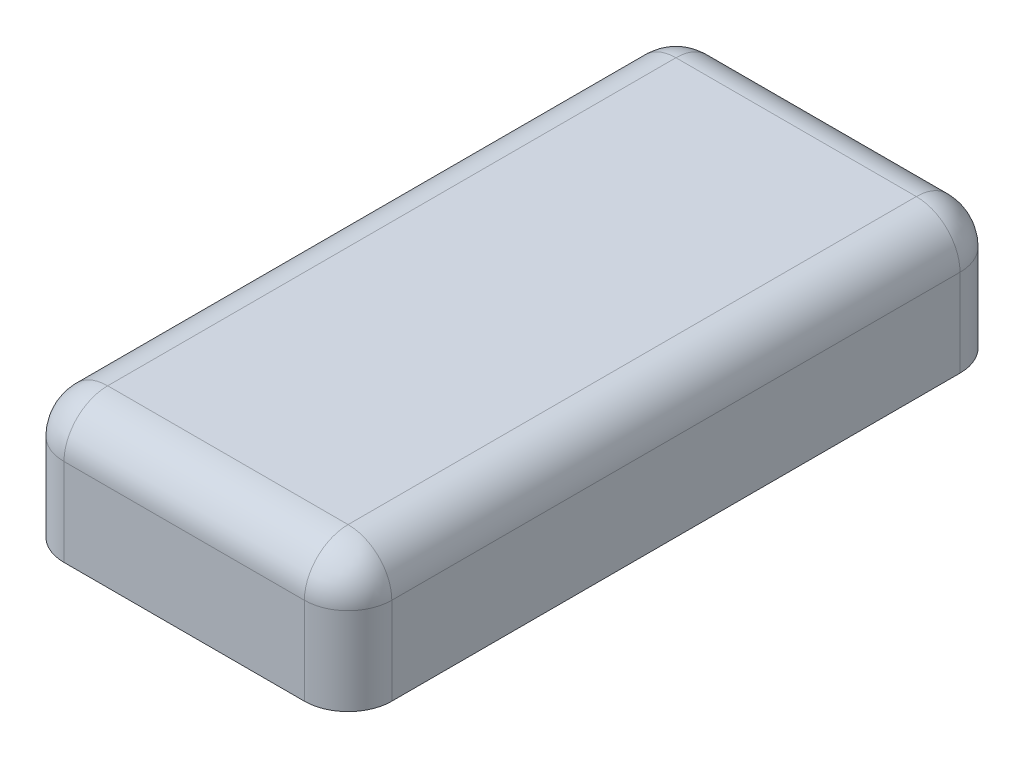
ISO-10303-21;
HEADER;
FILE_DESCRIPTION(('STEP AP214'),'2;1');
FILE_NAME('part.step','',(''),(''),'','','');
FILE_SCHEMA(('AUTOMOTIVE_DESIGN { 1 0 10303 214 1 1 1 1 }'));
ENDSEC;
DATA;
#1=APPLICATION_CONTEXT('core data for automotive mechanical design processes');
#2=APPLICATION_PROTOCOL_DEFINITION('international standard','automotive_design',2000,#1);
#3=PRODUCT_CONTEXT('',#1,'mechanical');
#4=PRODUCT('Part','Part','',(#3));
#5=PRODUCT_RELATED_PRODUCT_CATEGORY('part','',(#4));
#6=PRODUCT_DEFINITION_FORMATION('','',#4);
#7=PRODUCT_DEFINITION_CONTEXT('part definition',#1,'design');
#8=PRODUCT_DEFINITION('design','',#6,#7);
#9=PRODUCT_DEFINITION_SHAPE('','',#8);
#10=(LENGTH_UNIT() NAMED_UNIT(*) SI_UNIT(.MILLI.,.METRE.));
#11=(NAMED_UNIT(*) PLANE_ANGLE_UNIT() SI_UNIT($,.RADIAN.));
#12=(NAMED_UNIT(*) SI_UNIT($,.STERADIAN.) SOLID_ANGLE_UNIT());
#13=UNCERTAINTY_MEASURE_WITH_UNIT(LENGTH_MEASURE(1.E-05),#10,'distance_accuracy_value','');
#14=(GEOMETRIC_REPRESENTATION_CONTEXT(3) GLOBAL_UNCERTAINTY_ASSIGNED_CONTEXT((#13)) GLOBAL_UNIT_ASSIGNED_CONTEXT((#10,
#11,#12)) REPRESENTATION_CONTEXT('',''));
#15=CARTESIAN_POINT('',(0.,0.,0.));
#16=DIRECTION('',(0.,0.,1.));
#17=DIRECTION('',(1.,0.,0.));
#18=AXIS2_PLACEMENT_3D('',#15,#16,#17);
#19=CARTESIAN_POINT('',(0.75,0.6,-1.5));
#20=DIRECTION('',(-1.,0.,0.));
#21=DIRECTION('',(0.,0.,1.));
#22=AXIS2_PLACEMENT_3D('',#19,#20,#21);
#23=PLANE('',#22);
#24=DIRECTION('',(0.,-1.,0.));
#25=VECTOR('',#24,1.);
#26=CARTESIAN_POINT('',(0.75,0.6,-1.3));
#27=LINE('',#26,#25);
#28=CARTESIAN_POINT('',(0.75,0.,-1.3));
#29=VERTEX_POINT('',#28);
#30=CARTESIAN_POINT('',(0.75,0.4,-1.3));
#31=VERTEX_POINT('',#30);
#32=EDGE_CURVE('E125',#29,#31,#27,.F.);
#33=ORIENTED_EDGE('',*,*,#32,.T.);
#34=DIRECTION('',(0.,0.,-1.));
#35=VECTOR('',#34,1.);
#36=CARTESIAN_POINT('',(0.75,0.4,1.3));
#37=LINE('',#36,#35);
#38=CARTESIAN_POINT('',(0.75,0.4,1.3));
#39=VERTEX_POINT('',#38);
#40=EDGE_CURVE('E65',#31,#39,#37,.F.);
#41=ORIENTED_EDGE('',*,*,#40,.T.);
#42=DIRECTION('',(0.,-1.,0.));
#43=VECTOR('',#42,1.);
#44=CARTESIAN_POINT('',(0.75,0.6,1.3));
#45=LINE('',#44,#43);
#46=CARTESIAN_POINT('',(0.75,0.,1.3));
#47=VERTEX_POINT('',#46);
#48=EDGE_CURVE('E118',#39,#47,#45,.T.);
#49=ORIENTED_EDGE('',*,*,#48,.T.);
#50=DIRECTION('',(0.,0.,-1.));
#51=VECTOR('',#50,1.);
#52=CARTESIAN_POINT('',(0.75,0.,-1.5));
#53=LINE('',#52,#51);
#54=EDGE_CURVE('E121',#47,#29,#53,.T.);
#55=ORIENTED_EDGE('',*,*,#54,.T.);
#56=EDGE_LOOP('',(#33,#41,#49,#55));
#57=FACE_BOUND('',#56,.T.);
#58=ADVANCED_FACE('F41',(#57),#23,.F.);
#59=CARTESIAN_POINT('',(-0.75,0.6,-1.5));
#60=DIRECTION('',(0.,0.,1.));
#61=DIRECTION('',(1.,0.,0.));
#62=AXIS2_PLACEMENT_3D('',#59,#60,#61);
#63=PLANE('',#62);
#64=DIRECTION('',(0.,-1.,0.));
#65=VECTOR('',#64,1.);
#66=CARTESIAN_POINT('',(-0.55,0.6,-1.5));
#67=LINE('',#66,#65);
#68=CARTESIAN_POINT('',(-0.55,0.,-1.5));
#69=VERTEX_POINT('',#68);
#70=CARTESIAN_POINT('',(-0.55,0.4,-1.5));
#71=VERTEX_POINT('',#70);
#72=EDGE_CURVE('E158',#69,#71,#67,.F.);
#73=ORIENTED_EDGE('',*,*,#72,.T.);
#74=DIRECTION('',(-1.,0.,0.));
#75=VECTOR('',#74,1.);
#76=CARTESIAN_POINT('',(0.55,0.4,-1.5));
#77=LINE('',#76,#75);
#78=CARTESIAN_POINT('',(0.55,0.4,-1.5));
#79=VERTEX_POINT('',#78);
#80=EDGE_CURVE('E184',#71,#79,#77,.F.);
#81=ORIENTED_EDGE('',*,*,#80,.T.);
#82=DIRECTION('',(0.,-1.,0.));
#83=VECTOR('',#82,1.);
#84=CARTESIAN_POINT('',(0.55,0.6,-1.5));
#85=LINE('',#84,#83);
#86=CARTESIAN_POINT('',(0.55,0.,-1.5));
#87=VERTEX_POINT('',#86);
#88=EDGE_CURVE('E161',#79,#87,#85,.T.);
#89=ORIENTED_EDGE('',*,*,#88,.T.);
#90=DIRECTION('',(-1.,0.,0.));
#91=VECTOR('',#90,1.);
#92=CARTESIAN_POINT('',(-0.75,0.,-1.5));
#93=LINE('',#92,#91);
#94=EDGE_CURVE('E139',#87,#69,#93,.T.);
#95=ORIENTED_EDGE('',*,*,#94,.T.);
#96=EDGE_LOOP('',(#73,#81,#89,#95));
#97=FACE_BOUND('',#96,.T.);
#98=ADVANCED_FACE('F243',(#97),#63,.F.);
#99=CARTESIAN_POINT('',(-0.75,0.6,-1.5));
#100=DIRECTION('',(1.,0.,0.));
#101=DIRECTION('',(0.,0.,-1.));
#102=AXIS2_PLACEMENT_3D('',#99,#100,#101);
#103=PLANE('',#102);
#104=DIRECTION('',(0.,-1.,0.));
#105=VECTOR('',#104,1.);
#106=CARTESIAN_POINT('',(-0.75,0.6,1.3));
#107=LINE('',#106,#105);
#108=CARTESIAN_POINT('',(-0.75,0.,1.3));
#109=VERTEX_POINT('',#108);
#110=CARTESIAN_POINT('',(-0.75,0.4,1.3));
#111=VERTEX_POINT('',#110);
#112=EDGE_CURVE('E165',#109,#111,#107,.F.);
#113=ORIENTED_EDGE('',*,*,#112,.T.);
#114=DIRECTION('',(0.,0.,1.));
#115=VECTOR('',#114,1.);
#116=CARTESIAN_POINT('',(-0.75,0.4,-1.3));
#117=LINE('',#116,#115);
#118=CARTESIAN_POINT('',(-0.75,0.4,-1.3));
#119=VERTEX_POINT('',#118);
#120=EDGE_CURVE('E180',#111,#119,#117,.F.);
#121=ORIENTED_EDGE('',*,*,#120,.T.);
#122=DIRECTION('',(0.,-1.,0.));
#123=VECTOR('',#122,1.);
#124=CARTESIAN_POINT('',(-0.75,0.6,-1.3));
#125=LINE('',#124,#123);
#126=CARTESIAN_POINT('',(-0.75,0.,-1.3));
#127=VERTEX_POINT('',#126);
#128=EDGE_CURVE('E163',#119,#127,#125,.T.);
#129=ORIENTED_EDGE('',*,*,#128,.T.);
#130=DIRECTION('',(0.,0.,1.));
#131=VECTOR('',#130,1.);
#132=CARTESIAN_POINT('',(-0.75,0.,-1.5));
#133=LINE('',#132,#131);
#134=EDGE_CURVE('E142',#127,#109,#133,.T.);
#135=ORIENTED_EDGE('',*,*,#134,.T.);
#136=EDGE_LOOP('',(#113,#121,#129,#135));
#137=FACE_BOUND('',#136,.T.);
#138=ADVANCED_FACE('F249',(#137),#103,.F.);
#139=CARTESIAN_POINT('',(-0.75,0.6,1.5));
#140=DIRECTION('',(0.,0.,-1.));
#141=DIRECTION('',(-1.,0.,0.));
#142=AXIS2_PLACEMENT_3D('',#139,#140,#141);
#143=PLANE('',#142);
#144=DIRECTION('',(0.,-1.,0.));
#145=VECTOR('',#144,1.);
#146=CARTESIAN_POINT('',(0.55,0.6,1.5));
#147=LINE('',#146,#145);
#148=CARTESIAN_POINT('',(0.55,0.,1.5));
#149=VERTEX_POINT('',#148);
#150=CARTESIAN_POINT('',(0.55,0.4,1.5));
#151=VERTEX_POINT('',#150);
#152=EDGE_CURVE('E129',#149,#151,#147,.F.);
#153=ORIENTED_EDGE('',*,*,#152,.T.);
#154=DIRECTION('',(1.,0.,0.));
#155=VECTOR('',#154,1.);
#156=CARTESIAN_POINT('',(-0.55,0.4,1.5));
#157=LINE('',#156,#155);
#158=CARTESIAN_POINT('',(-0.55,0.4,1.5));
#159=VERTEX_POINT('',#158);
#160=EDGE_CURVE('E11',#151,#159,#157,.F.);
#161=ORIENTED_EDGE('',*,*,#160,.T.);
#162=DIRECTION('',(0.,-1.,0.));
#163=VECTOR('',#162,1.);
#164=CARTESIAN_POINT('',(-0.55,0.6,1.5));
#165=LINE('',#164,#163);
#166=CARTESIAN_POINT('',(-0.55,0.,1.5));
#167=VERTEX_POINT('',#166);
#168=EDGE_CURVE('E133',#159,#167,#165,.T.);
#169=ORIENTED_EDGE('',*,*,#168,.T.);
#170=DIRECTION('',(1.,0.,0.));
#171=VECTOR('',#170,1.);
#172=CARTESIAN_POINT('',(-0.75,0.,1.5));
#173=LINE('',#172,#171);
#174=EDGE_CURVE('E149',#167,#149,#173,.T.);
#175=ORIENTED_EDGE('',*,*,#174,.T.);
#176=EDGE_LOOP('',(#153,#161,#169,#175));
#177=FACE_BOUND('',#176,.T.);
#178=ADVANCED_FACE('F342',(#177),#143,.F.);
#179=CARTESIAN_POINT('',(0.,0.6,0.));
#180=DIRECTION('',(0.,1.,0.));
#181=DIRECTION('',(0.,0.,1.));
#182=AXIS2_PLACEMENT_3D('',#179,#180,#181);
#183=PLANE('',#182);
#184=DIRECTION('',(-1.,0.,0.));
#185=VECTOR('',#184,1.);
#186=CARTESIAN_POINT('',(-0.55,0.6,-1.3));
#187=LINE('',#186,#185);
#188=CARTESIAN_POINT('',(0.55,0.6,-1.3));
#189=VERTEX_POINT('',#188);
#190=CARTESIAN_POINT('',(-0.55,0.6,-1.3));
#191=VERTEX_POINT('',#190);
#192=EDGE_CURVE('E175',#189,#191,#187,.T.);
#193=ORIENTED_EDGE('',*,*,#192,.T.);
#194=DIRECTION('',(0.,0.,1.));
#195=VECTOR('',#194,1.);
#196=CARTESIAN_POINT('',(-0.55,0.6,1.3));
#197=LINE('',#196,#195);
#198=CARTESIAN_POINT('',(-0.55,0.6,1.3));
#199=VERTEX_POINT('',#198);
#200=EDGE_CURVE('E177',#191,#199,#197,.T.);
#201=ORIENTED_EDGE('',*,*,#200,.T.);
#202=DIRECTION('',(1.,0.,0.));
#203=VECTOR('',#202,1.);
#204=CARTESIAN_POINT('',(0.55,0.6,1.3));
#205=LINE('',#204,#203);
#206=CARTESIAN_POINT('',(0.55,0.6,1.3));
#207=VERTEX_POINT('',#206);
#208=EDGE_CURVE('E171',#199,#207,#205,.T.);
#209=ORIENTED_EDGE('',*,*,#208,.T.);
#210=DIRECTION('',(0.,0.,-1.));
#211=VECTOR('',#210,1.);
#212=CARTESIAN_POINT('',(0.55,0.6,-1.3));
#213=LINE('',#212,#211);
#214=EDGE_CURVE('E173',#207,#189,#213,.T.);
#215=ORIENTED_EDGE('',*,*,#214,.T.);
#216=EDGE_LOOP('',(#193,#201,#209,#215));
#217=FACE_BOUND('',#216,.T.);
#218=ADVANCED_FACE('F220',(#217),#183,.T.);
#219=CARTESIAN_POINT('',(0.,0.,0.));
#220=DIRECTION('',(0.,1.,0.));
#221=DIRECTION('',(0.,0.,1.));
#222=AXIS2_PLACEMENT_3D('',#219,#220,#221);
#223=PLANE('',#222);
#224=ORIENTED_EDGE('',*,*,#54,.F.);
#225=CARTESIAN_POINT('',(0.55,0.,1.3));
#226=DIRECTION('',(0.,1.,0.));
#227=DIRECTION('',(0.,0.,1.));
#228=AXIS2_PLACEMENT_3D('',#225,#226,#227);
#229=CIRCLE('',#228,0.2);
#230=EDGE_CURVE('E127',#47,#149,#229,.F.);
#231=ORIENTED_EDGE('',*,*,#230,.T.);
#232=ORIENTED_EDGE('',*,*,#174,.F.);
#233=CARTESIAN_POINT('',(-0.55,0.,1.3));
#234=DIRECTION('',(0.,1.,0.));
#235=DIRECTION('',(0.,0.,1.));
#236=AXIS2_PLACEMENT_3D('',#233,#234,#235);
#237=CIRCLE('',#236,0.2);
#238=EDGE_CURVE('E153',#167,#109,#237,.F.);
#239=ORIENTED_EDGE('',*,*,#238,.T.);
#240=ORIENTED_EDGE('',*,*,#134,.F.);
#241=CARTESIAN_POINT('',(-0.55,0.,-1.3));
#242=DIRECTION('',(0.,1.,0.));
#243=DIRECTION('',(0.,0.,1.));
#244=AXIS2_PLACEMENT_3D('',#241,#242,#243);
#245=CIRCLE('',#244,0.2);
#246=EDGE_CURVE('E124',#127,#69,#245,.F.);
#247=ORIENTED_EDGE('',*,*,#246,.T.);
#248=ORIENTED_EDGE('',*,*,#94,.F.);
#249=CARTESIAN_POINT('',(0.55,0.,-1.3));
#250=DIRECTION('',(0.,1.,0.));
#251=DIRECTION('',(0.,0.,1.));
#252=AXIS2_PLACEMENT_3D('',#249,#250,#251);
#253=CIRCLE('',#252,0.2);
#254=EDGE_CURVE('E134',#87,#29,#253,.F.);
#255=ORIENTED_EDGE('',*,*,#254,.T.);
#256=EDGE_LOOP('',(#224,#231,#232,#239,#240,#247,#248,#255));
#257=FACE_BOUND('',#256,.T.);
#258=ADVANCED_FACE('F136',(#257),#223,.F.);
#259=CARTESIAN_POINT('',(0.55,0.6,1.3));
#260=DIRECTION('',(0.,-1.,0.));
#261=DIRECTION('',(0.,0.,-1.));
#262=AXIS2_PLACEMENT_3D('',#259,#260,#261);
#263=CYLINDRICAL_SURFACE('',#262,0.2);
#264=ORIENTED_EDGE('',*,*,#48,.F.);
#265=CARTESIAN_POINT('',(0.55,0.4,1.3));
#266=DIRECTION('',(0.,-1.,0.));
#267=DIRECTION('',(0.,0.,-1.));
#268=AXIS2_PLACEMENT_3D('',#265,#266,#267);
#269=CIRCLE('',#268,0.2);
#270=EDGE_CURVE('E50',#39,#151,#269,.T.);
#271=ORIENTED_EDGE('',*,*,#270,.T.);
#272=ORIENTED_EDGE('',*,*,#152,.F.);
#273=ORIENTED_EDGE('',*,*,#230,.F.);
#274=EDGE_LOOP('',(#264,#271,#272,#273));
#275=FACE_BOUND('',#274,.T.);
#276=ADVANCED_FACE('F128',(#275),#263,.T.);
#277=CARTESIAN_POINT('',(0.55,0.6,-1.3));
#278=DIRECTION('',(0.,-1.,0.));
#279=DIRECTION('',(0.,0.,-1.));
#280=AXIS2_PLACEMENT_3D('',#277,#278,#279);
#281=CYLINDRICAL_SURFACE('',#280,0.2);
#282=ORIENTED_EDGE('',*,*,#88,.F.);
#283=CARTESIAN_POINT('',(0.55,0.4,-1.3));
#284=DIRECTION('',(0.,-1.,0.));
#285=DIRECTION('',(0.,0.,-1.));
#286=AXIS2_PLACEMENT_3D('',#283,#284,#285);
#287=CIRCLE('',#286,0.2);
#288=EDGE_CURVE('E186',#79,#31,#287,.T.);
#289=ORIENTED_EDGE('',*,*,#288,.T.);
#290=ORIENTED_EDGE('',*,*,#32,.F.);
#291=ORIENTED_EDGE('',*,*,#254,.F.);
#292=EDGE_LOOP('',(#282,#289,#290,#291));
#293=FACE_BOUND('',#292,.T.);
#294=ADVANCED_FACE('F256',(#293),#281,.T.);
#295=CARTESIAN_POINT('',(-0.55,0.6,1.3));
#296=DIRECTION('',(0.,-1.,0.));
#297=DIRECTION('',(0.,0.,-1.));
#298=AXIS2_PLACEMENT_3D('',#295,#296,#297);
#299=CYLINDRICAL_SURFACE('',#298,0.2);
#300=ORIENTED_EDGE('',*,*,#168,.F.);
#301=CARTESIAN_POINT('',(-0.55,0.4,1.3));
#302=DIRECTION('',(0.,-1.,0.));
#303=DIRECTION('',(0.,0.,-1.));
#304=AXIS2_PLACEMENT_3D('',#301,#302,#303);
#305=CIRCLE('',#304,0.2);
#306=EDGE_CURVE('E168',#159,#111,#305,.T.);
#307=ORIENTED_EDGE('',*,*,#306,.T.);
#308=ORIENTED_EDGE('',*,*,#112,.F.);
#309=ORIENTED_EDGE('',*,*,#238,.F.);
#310=EDGE_LOOP('',(#300,#307,#308,#309));
#311=FACE_BOUND('',#310,.T.);
#312=ADVANCED_FACE('F259',(#311),#299,.T.);
#313=CARTESIAN_POINT('',(-0.55,0.6,-1.3));
#314=DIRECTION('',(0.,-1.,0.));
#315=DIRECTION('',(0.,0.,-1.));
#316=AXIS2_PLACEMENT_3D('',#313,#314,#315);
#317=CYLINDRICAL_SURFACE('',#316,0.2);
#318=ORIENTED_EDGE('',*,*,#128,.F.);
#319=CARTESIAN_POINT('',(-0.55,0.4,-1.3));
#320=DIRECTION('',(0.,-1.,0.));
#321=DIRECTION('',(0.,0.,-1.));
#322=AXIS2_PLACEMENT_3D('',#319,#320,#321);
#323=CIRCLE('',#322,0.2);
#324=EDGE_CURVE('E182',#119,#71,#323,.T.);
#325=ORIENTED_EDGE('',*,*,#324,.T.);
#326=ORIENTED_EDGE('',*,*,#72,.F.);
#327=ORIENTED_EDGE('',*,*,#246,.F.);
#328=EDGE_LOOP('',(#318,#325,#326,#327));
#329=FACE_BOUND('',#328,.T.);
#330=ADVANCED_FACE('F263',(#329),#317,.T.);
#331=CARTESIAN_POINT('',(0.55,0.4,-1.3));
#332=DIRECTION('',(0.,1.,0.));
#333=DIRECTION('',(0.,0.,1.));
#334=AXIS2_PLACEMENT_3D('',#331,#332,#333);
#335=SPHERICAL_SURFACE('',#334,0.2);
#336=CARTESIAN_POINT('',(0.55,0.4,-1.3));
#337=DIRECTION('',(0.,0.,1.));
#338=DIRECTION('',(1.,0.,0.));
#339=AXIS2_PLACEMENT_3D('',#336,#337,#338);
#340=CIRCLE('',#339,0.2);
#341=EDGE_CURVE('E145',#31,#189,#340,.T.);
#342=ORIENTED_EDGE('',*,*,#341,.F.);
#343=ORIENTED_EDGE('',*,*,#288,.F.);
#344=CARTESIAN_POINT('',(0.55,0.4,-1.3));
#345=DIRECTION('',(-1.,0.,0.));
#346=DIRECTION('',(0.,0.,1.));
#347=AXIS2_PLACEMENT_3D('',#344,#345,#346);
#348=CIRCLE('',#347,0.2);
#349=EDGE_CURVE('E45',#189,#79,#348,.T.);
#350=ORIENTED_EDGE('',*,*,#349,.F.);
#351=EDGE_LOOP('',(#342,#343,#350));
#352=FACE_BOUND('',#351,.T.);
#353=ADVANCED_FACE('F43',(#352),#335,.T.);
#354=CARTESIAN_POINT('',(0.,0.4,-1.3));
#355=DIRECTION('',(1.,0.,0.));
#356=DIRECTION('',(0.,0.,-1.));
#357=AXIS2_PLACEMENT_3D('',#354,#355,#356);
#358=CYLINDRICAL_SURFACE('',#357,0.2);
#359=ORIENTED_EDGE('',*,*,#349,.T.);
#360=ORIENTED_EDGE('',*,*,#80,.F.);
#361=CARTESIAN_POINT('',(-0.55,0.4,-1.3));
#362=DIRECTION('',(-1.,0.,0.));
#363=DIRECTION('',(0.,0.,1.));
#364=AXIS2_PLACEMENT_3D('',#361,#362,#363);
#365=CIRCLE('',#364,0.2);
#366=EDGE_CURVE('E203',#191,#71,#365,.T.);
#367=ORIENTED_EDGE('',*,*,#366,.F.);
#368=ORIENTED_EDGE('',*,*,#192,.F.);
#369=EDGE_LOOP('',(#359,#360,#367,#368));
#370=FACE_BOUND('',#369,.T.);
#371=ADVANCED_FACE('F217',(#370),#358,.T.);
#372=CARTESIAN_POINT('',(0.55,0.4,0.));
#373=DIRECTION('',(0.,0.,1.));
#374=DIRECTION('',(1.,0.,0.));
#375=AXIS2_PLACEMENT_3D('',#372,#373,#374);
#376=CYLINDRICAL_SURFACE('',#375,0.2);
#377=ORIENTED_EDGE('',*,*,#341,.T.);
#378=ORIENTED_EDGE('',*,*,#214,.F.);
#379=CARTESIAN_POINT('',(0.55,0.4,1.3));
#380=DIRECTION('',(0.,0.,1.));
#381=DIRECTION('',(1.,0.,0.));
#382=AXIS2_PLACEMENT_3D('',#379,#380,#381);
#383=CIRCLE('',#382,0.2);
#384=EDGE_CURVE('E200',#39,#207,#383,.T.);
#385=ORIENTED_EDGE('',*,*,#384,.F.);
#386=ORIENTED_EDGE('',*,*,#40,.F.);
#387=EDGE_LOOP('',(#377,#378,#385,#386));
#388=FACE_BOUND('',#387,.T.);
#389=ADVANCED_FACE('F210',(#388),#376,.T.);
#390=CARTESIAN_POINT('',(-0.55,0.4,-1.3));
#391=DIRECTION('',(0.,1.,0.));
#392=DIRECTION('',(0.,0.,1.));
#393=AXIS2_PLACEMENT_3D('',#390,#391,#392);
#394=SPHERICAL_SURFACE('',#393,0.2);
#395=ORIENTED_EDGE('',*,*,#366,.T.);
#396=ORIENTED_EDGE('',*,*,#324,.F.);
#397=CARTESIAN_POINT('',(-0.55,0.4,-1.3));
#398=DIRECTION('',(0.,0.,1.));
#399=DIRECTION('',(1.,0.,0.));
#400=AXIS2_PLACEMENT_3D('',#397,#398,#399);
#401=CIRCLE('',#400,0.2);
#402=EDGE_CURVE('E197',#191,#119,#401,.T.);
#403=ORIENTED_EDGE('',*,*,#402,.F.);
#404=EDGE_LOOP('',(#395,#396,#403));
#405=FACE_BOUND('',#404,.T.);
#406=ADVANCED_FACE('F232',(#405),#394,.T.);
#407=CARTESIAN_POINT('',(0.55,0.4,1.3));
#408=DIRECTION('',(0.,1.,0.));
#409=DIRECTION('',(0.,0.,1.));
#410=AXIS2_PLACEMENT_3D('',#407,#408,#409);
#411=SPHERICAL_SURFACE('',#410,0.2);
#412=ORIENTED_EDGE('',*,*,#270,.F.);
#413=ORIENTED_EDGE('',*,*,#384,.T.);
#414=CARTESIAN_POINT('',(0.55,0.4,1.3));
#415=DIRECTION('',(-1.,0.,0.));
#416=DIRECTION('',(0.,0.,1.));
#417=AXIS2_PLACEMENT_3D('',#414,#415,#416);
#418=CIRCLE('',#417,0.2);
#419=EDGE_CURVE('E194',#151,#207,#418,.T.);
#420=ORIENTED_EDGE('',*,*,#419,.F.);
#421=EDGE_LOOP('',(#412,#413,#420));
#422=FACE_BOUND('',#421,.T.);
#423=ADVANCED_FACE('F229',(#422),#411,.T.);
#424=CARTESIAN_POINT('',(-0.55,0.4,0.));
#425=DIRECTION('',(0.,0.,-1.));
#426=DIRECTION('',(-1.,0.,0.));
#427=AXIS2_PLACEMENT_3D('',#424,#425,#426);
#428=CYLINDRICAL_SURFACE('',#427,0.2);
#429=ORIENTED_EDGE('',*,*,#402,.T.);
#430=ORIENTED_EDGE('',*,*,#120,.F.);
#431=CARTESIAN_POINT('',(-0.55,0.4,1.3));
#432=DIRECTION('',(0.,0.,1.));
#433=DIRECTION('',(1.,0.,0.));
#434=AXIS2_PLACEMENT_3D('',#431,#432,#433);
#435=CIRCLE('',#434,0.2);
#436=EDGE_CURVE('E192',#199,#111,#435,.T.);
#437=ORIENTED_EDGE('',*,*,#436,.F.);
#438=ORIENTED_EDGE('',*,*,#200,.F.);
#439=EDGE_LOOP('',(#429,#430,#437,#438));
#440=FACE_BOUND('',#439,.T.);
#441=ADVANCED_FACE('F231',(#440),#428,.T.);
#442=CARTESIAN_POINT('',(0.,0.4,1.3));
#443=DIRECTION('',(-1.,0.,0.));
#444=DIRECTION('',(0.,0.,1.));
#445=AXIS2_PLACEMENT_3D('',#442,#443,#444);
#446=CYLINDRICAL_SURFACE('',#445,0.2);
#447=ORIENTED_EDGE('',*,*,#419,.T.);
#448=ORIENTED_EDGE('',*,*,#208,.F.);
#449=CARTESIAN_POINT('',(-0.55,0.4,1.3));
#450=DIRECTION('',(-1.,0.,0.));
#451=DIRECTION('',(0.,0.,1.));
#452=AXIS2_PLACEMENT_3D('',#449,#450,#451);
#453=CIRCLE('',#452,0.2);
#454=EDGE_CURVE('E190',#159,#199,#453,.T.);
#455=ORIENTED_EDGE('',*,*,#454,.F.);
#456=ORIENTED_EDGE('',*,*,#160,.F.);
#457=EDGE_LOOP('',(#447,#448,#455,#456));
#458=FACE_BOUND('',#457,.T.);
#459=ADVANCED_FACE('F225',(#458),#446,.T.);
#460=CARTESIAN_POINT('',(-0.55,0.4,1.3));
#461=DIRECTION('',(0.,1.,0.));
#462=DIRECTION('',(0.,0.,1.));
#463=AXIS2_PLACEMENT_3D('',#460,#461,#462);
#464=SPHERICAL_SURFACE('',#463,0.2);
#465=ORIENTED_EDGE('',*,*,#436,.T.);
#466=ORIENTED_EDGE('',*,*,#306,.F.);
#467=ORIENTED_EDGE('',*,*,#454,.T.);
#468=EDGE_LOOP('',(#465,#466,#467));
#469=FACE_BOUND('',#468,.T.);
#470=ADVANCED_FACE('F268',(#469),#464,.T.);
#471=CLOSED_SHELL('',(#58,#98,#138,#178,#218,#258,#276,#294,#312,#330,#353,#371,#389,#406,#423,
#441,#459,#470));
#472=MANIFOLD_SOLID_BREP('B2',#471);
#473=ADVANCED_BREP_SHAPE_REPRESENTATION('',(#18,#472),#14);
#474=SHAPE_DEFINITION_REPRESENTATION(#9,#473);
ENDSEC;
END-ISO-10303-21;
